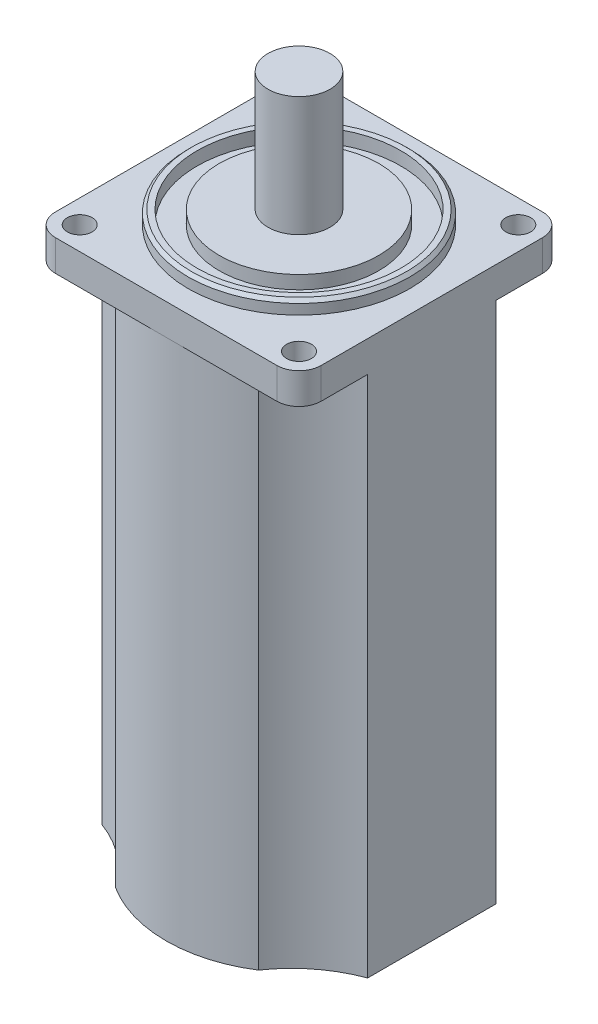
ISO-10303-21;
HEADER;
FILE_DESCRIPTION(('STEP AP214'),'2;1');
FILE_NAME('part.step','',(''),(''),'','','');
FILE_SCHEMA(('AUTOMOTIVE_DESIGN { 1 0 10303 214 1 1 1 1 }'));
ENDSEC;
DATA;
#1=APPLICATION_CONTEXT('core data for automotive mechanical design processes');
#2=APPLICATION_PROTOCOL_DEFINITION('international standard','automotive_design',2000,#1);
#3=PRODUCT_CONTEXT('',#1,'mechanical');
#4=PRODUCT('Part','Part','',(#3));
#5=PRODUCT_RELATED_PRODUCT_CATEGORY('part','',(#4));
#6=PRODUCT_DEFINITION_FORMATION('','',#4);
#7=PRODUCT_DEFINITION_CONTEXT('part definition',#1,'design');
#8=PRODUCT_DEFINITION('design','',#6,#7);
#9=PRODUCT_DEFINITION_SHAPE('','',#8);
#10=(LENGTH_UNIT() NAMED_UNIT(*) SI_UNIT(.MILLI.,.METRE.));
#11=(NAMED_UNIT(*) PLANE_ANGLE_UNIT() SI_UNIT($,.RADIAN.));
#12=(NAMED_UNIT(*) SI_UNIT($,.STERADIAN.) SOLID_ANGLE_UNIT());
#13=UNCERTAINTY_MEASURE_WITH_UNIT(LENGTH_MEASURE(1.E-05),#10,'distance_accuracy_value','');
#14=(GEOMETRIC_REPRESENTATION_CONTEXT(3) GLOBAL_UNCERTAINTY_ASSIGNED_CONTEXT((#13)) GLOBAL_UNIT_ASSIGNED_CONTEXT((#10,
#11,#12)) REPRESENTATION_CONTEXT('',''));
#15=CARTESIAN_POINT('',(0.,0.,0.));
#16=DIRECTION('',(0.,0.,1.));
#17=DIRECTION('',(1.,0.,0.));
#18=AXIS2_PLACEMENT_3D('',#15,#16,#17);
#19=CARTESIAN_POINT('',(-25.,0.,25.));
#20=DIRECTION('',(0.,-1.,0.));
#21=DIRECTION('',(0.,0.,-1.));
#22=AXIS2_PLACEMENT_3D('',#19,#20,#21);
#23=PLANE('',#22);
#24=CARTESIAN_POINT('',(40.0314224653781,0.,-41.7097512543042));
#25=DIRECTION('',(0.,1.,0.));
#26=DIRECTION('',(0.,0.,1.));
#27=AXIS2_PLACEMENT_3D('',#24,#25,#26);
#28=CIRCLE('',#27,29.);
#29=CARTESIAN_POINT('',(16.12,0.,-25.3010987903688));
#30=VERTEX_POINT('',#29);
#31=CARTESIAN_POINT('',(30.,0.,-14.5));
#32=VERTEX_POINT('',#31);
#33=EDGE_CURVE('E57',#30,#32,#28,.T.);
#34=ORIENTED_EDGE('',*,*,#33,.F.);
#35=CARTESIAN_POINT('',(0.,0.,0.));
#36=DIRECTION('',(0.,-1.,0.));
#37=DIRECTION('',(0.,0.,1.));
#38=AXIS2_PLACEMENT_3D('',#35,#36,#37);
#39=CIRCLE('',#38,30.);
#40=CARTESIAN_POINT('',(0.,0.,-30.));
#41=VERTEX_POINT('',#40);
#42=EDGE_CURVE('E49',#41,#30,#39,.T.);
#43=ORIENTED_EDGE('',*,*,#42,.F.);
#44=DIRECTION('',(-1.,0.,0.));
#45=VECTOR('',#44,1.);
#46=CARTESIAN_POINT('',(-25.,0.,-30.));
#47=LINE('',#46,#45);
#48=CARTESIAN_POINT('',(25.,0.,-30.));
#49=VERTEX_POINT('',#48);
#50=EDGE_CURVE('E260',#49,#41,#47,.T.);
#51=ORIENTED_EDGE('',*,*,#50,.F.);
#52=CARTESIAN_POINT('',(25.,0.,-25.));
#53=DIRECTION('',(0.,1.,0.));
#54=DIRECTION('',(0.,0.,-1.));
#55=AXIS2_PLACEMENT_3D('',#52,#53,#54);
#56=CIRCLE('',#55,5.);
#57=CARTESIAN_POINT('',(30.,0.,-25.));
#58=VERTEX_POINT('',#57);
#59=EDGE_CURVE('E257',#58,#49,#56,.T.);
#60=ORIENTED_EDGE('',*,*,#59,.F.);
#61=DIRECTION('',(0.,0.,-1.));
#62=VECTOR('',#61,1.);
#63=CARTESIAN_POINT('',(30.,0.,25.));
#64=LINE('',#63,#62);
#65=EDGE_CURVE('E253',#32,#58,#64,.T.);
#66=ORIENTED_EDGE('',*,*,#65,.F.);
#67=EDGE_LOOP('',(#34,#43,#51,#60,#66));
#68=FACE_BOUND('',#67,.T.);
#69=CARTESIAN_POINT('',(24.7487373415292,0.,-24.7487373415292));
#70=DIRECTION('',(0.,1.,0.));
#71=DIRECTION('',(0.,0.,-1.));
#72=AXIS2_PLACEMENT_3D('',#69,#70,#71);
#73=CIRCLE('',#72,2.8);
#74=CARTESIAN_POINT('',(24.7487373415292,0.,-27.5487373415292));
#75=VERTEX_POINT('',#74);
#76=EDGE_CURVE('E211',#75,#75,#73,.T.);
#77=ORIENTED_EDGE('',*,*,#76,.T.);
#78=EDGE_LOOP('',(#77));
#79=FACE_BOUND('',#78,.T.);
#80=ADVANCED_FACE('F40',(#68,#79),#23,.T.);
#81=CARTESIAN_POINT('',(-16.12,0.,-25.3010987903688));
#82=VERTEX_POINT('',#81);
#83=EDGE_CURVE('E65',#82,#41,#39,.T.);
#84=ORIENTED_EDGE('',*,*,#83,.F.);
#85=CARTESIAN_POINT('',(-40.031422465378,0.,-41.7097512543042));
#86=DIRECTION('',(0.,1.,0.));
#87=DIRECTION('',(0.,0.,-1.));
#88=AXIS2_PLACEMENT_3D('',#85,#86,#87);
#89=CIRCLE('',#88,29.);
#90=CARTESIAN_POINT('',(-30.,0.,-14.5));
#91=VERTEX_POINT('',#90);
#92=EDGE_CURVE('E311',#91,#82,#89,.T.);
#93=ORIENTED_EDGE('',*,*,#92,.F.);
#94=DIRECTION('',(0.,0.,1.));
#95=VECTOR('',#94,1.);
#96=CARTESIAN_POINT('',(-30.,0.,25.));
#97=LINE('',#96,#95);
#98=CARTESIAN_POINT('',(-30.,0.,-25.));
#99=VERTEX_POINT('',#98);
#100=EDGE_CURVE('E230',#99,#91,#97,.T.);
#101=ORIENTED_EDGE('',*,*,#100,.F.);
#102=CARTESIAN_POINT('',(-25.,0.,-25.));
#103=DIRECTION('',(0.,1.,0.));
#104=DIRECTION('',(0.,0.,-1.));
#105=AXIS2_PLACEMENT_3D('',#102,#103,#104);
#106=CIRCLE('',#105,5.);
#107=CARTESIAN_POINT('',(-25.,0.,-30.));
#108=VERTEX_POINT('',#107);
#109=EDGE_CURVE('E263',#108,#99,#106,.T.);
#110=ORIENTED_EDGE('',*,*,#109,.F.);
#111=EDGE_CURVE('E259',#41,#108,#47,.T.);
#112=ORIENTED_EDGE('',*,*,#111,.F.);
#113=EDGE_LOOP('',(#84,#93,#101,#110,#112));
#114=FACE_BOUND('',#113,.T.);
#115=CARTESIAN_POINT('',(-24.7487373415292,0.,-24.7487373415292));
#116=DIRECTION('',(0.,1.,0.));
#117=DIRECTION('',(0.,0.,1.));
#118=AXIS2_PLACEMENT_3D('',#115,#116,#117);
#119=CIRCLE('',#118,2.8);
#120=CARTESIAN_POINT('',(-24.7487373415292,0.,-21.9487373415292));
#121=VERTEX_POINT('',#120);
#122=EDGE_CURVE('E217',#121,#121,#119,.T.);
#123=ORIENTED_EDGE('',*,*,#122,.T.);
#124=EDGE_LOOP('',(#123));
#125=FACE_BOUND('',#124,.T.);
#126=ADVANCED_FACE('F365',(#114,#125),#23,.T.);
#127=CARTESIAN_POINT('',(40.0314224653781,0.,41.7097512543042));
#128=DIRECTION('',(0.,1.,0.));
#129=DIRECTION('',(0.,0.,-1.));
#130=AXIS2_PLACEMENT_3D('',#127,#128,#129);
#131=CIRCLE('',#130,29.);
#132=CARTESIAN_POINT('',(30.,0.,14.5));
#133=VERTEX_POINT('',#132);
#134=CARTESIAN_POINT('',(16.12,0.,25.3010987903688));
#135=VERTEX_POINT('',#134);
#136=EDGE_CURVE('E186',#133,#135,#131,.T.);
#137=ORIENTED_EDGE('',*,*,#136,.F.);
#138=CARTESIAN_POINT('',(30.,0.,25.));
#139=VERTEX_POINT('',#138);
#140=EDGE_CURVE('E254',#139,#133,#64,.T.);
#141=ORIENTED_EDGE('',*,*,#140,.F.);
#142=CARTESIAN_POINT('',(25.,0.,25.));
#143=DIRECTION('',(0.,1.,0.));
#144=DIRECTION('',(0.,0.,1.));
#145=AXIS2_PLACEMENT_3D('',#142,#143,#144);
#146=CIRCLE('',#145,5.);
#147=CARTESIAN_POINT('',(25.,0.,30.));
#148=VERTEX_POINT('',#147);
#149=EDGE_CURVE('E251',#148,#139,#146,.T.);
#150=ORIENTED_EDGE('',*,*,#149,.F.);
#151=DIRECTION('',(1.,0.,0.));
#152=VECTOR('',#151,1.);
#153=CARTESIAN_POINT('',(-25.,0.,30.));
#154=LINE('',#153,#152);
#155=CARTESIAN_POINT('',(0.,0.,30.));
#156=VERTEX_POINT('',#155);
#157=EDGE_CURVE('E247',#156,#148,#154,.T.);
#158=ORIENTED_EDGE('',*,*,#157,.F.);
#159=CARTESIAN_POINT('',(0.,0.,0.));
#160=DIRECTION('',(0.,-1.,0.));
#161=DIRECTION('',(0.,0.,-1.));
#162=AXIS2_PLACEMENT_3D('',#159,#160,#161);
#163=CIRCLE('',#162,30.);
#164=EDGE_CURVE('E305',#135,#156,#163,.T.);
#165=ORIENTED_EDGE('',*,*,#164,.F.);
#166=EDGE_LOOP('',(#137,#141,#150,#158,#165));
#167=FACE_BOUND('',#166,.T.);
#168=CARTESIAN_POINT('',(24.7487373415292,0.,24.7487373415292));
#169=DIRECTION('',(0.,1.,0.));
#170=DIRECTION('',(0.,0.,1.));
#171=AXIS2_PLACEMENT_3D('',#168,#169,#170);
#172=CIRCLE('',#171,2.8);
#173=CARTESIAN_POINT('',(24.7487373415292,0.,27.5487373415292));
#174=VERTEX_POINT('',#173);
#175=EDGE_CURVE('E205',#174,#174,#172,.T.);
#176=ORIENTED_EDGE('',*,*,#175,.T.);
#177=EDGE_LOOP('',(#176));
#178=FACE_BOUND('',#177,.T.);
#179=ADVANCED_FACE('F400',(#167,#178),#23,.T.);
#180=CARTESIAN_POINT('',(-25.,7.,25.));
#181=DIRECTION('',(0.,-1.,0.));
#182=DIRECTION('',(0.,0.,-1.));
#183=AXIS2_PLACEMENT_3D('',#180,#181,#182);
#184=PLANE('',#183);
#185=CARTESIAN_POINT('',(0.,7.,0.));
#186=DIRECTION('',(0.,-1.,0.));
#187=DIRECTION('',(0.,0.,-1.));
#188=AXIS2_PLACEMENT_3D('',#185,#186,#187);
#189=CIRCLE('',#188,25.);
#190=CARTESIAN_POINT('',(0.,7.,-25.));
#191=VERTEX_POINT('',#190);
#192=EDGE_CURVE('E291',#191,#191,#189,.F.);
#193=ORIENTED_EDGE('',*,*,#192,.F.);
#194=EDGE_LOOP('',(#193));
#195=FACE_BOUND('',#194,.T.);
#196=CARTESIAN_POINT('',(-25.,7.,25.));
#197=DIRECTION('',(0.,1.,0.));
#198=DIRECTION('',(0.,0.,-1.));
#199=AXIS2_PLACEMENT_3D('',#196,#197,#198);
#200=CIRCLE('',#199,5.);
#201=CARTESIAN_POINT('',(-30.,7.,25.));
#202=VERTEX_POINT('',#201);
#203=CARTESIAN_POINT('',(-25.,7.,30.));
#204=VERTEX_POINT('',#203);
#205=EDGE_CURVE('E226',#202,#204,#200,.T.);
#206=ORIENTED_EDGE('',*,*,#205,.T.);
#207=DIRECTION('',(1.,0.,0.));
#208=VECTOR('',#207,1.);
#209=CARTESIAN_POINT('',(-25.,7.,30.));
#210=LINE('',#209,#208);
#211=CARTESIAN_POINT('',(25.,7.,30.));
#212=VERTEX_POINT('',#211);
#213=EDGE_CURVE('E229',#204,#212,#210,.T.);
#214=ORIENTED_EDGE('',*,*,#213,.T.);
#215=CARTESIAN_POINT('',(25.,7.,25.));
#216=DIRECTION('',(0.,1.,0.));
#217=DIRECTION('',(0.,0.,1.));
#218=AXIS2_PLACEMENT_3D('',#215,#216,#217);
#219=CIRCLE('',#218,5.);
#220=CARTESIAN_POINT('',(30.,7.,25.));
#221=VERTEX_POINT('',#220);
#222=EDGE_CURVE('E232',#212,#221,#219,.T.);
#223=ORIENTED_EDGE('',*,*,#222,.T.);
#224=DIRECTION('',(0.,0.,-1.));
#225=VECTOR('',#224,1.);
#226=CARTESIAN_POINT('',(30.,7.,25.));
#227=LINE('',#226,#225);
#228=CARTESIAN_POINT('',(30.,7.,-25.));
#229=VERTEX_POINT('',#228);
#230=EDGE_CURVE('E234',#221,#229,#227,.T.);
#231=ORIENTED_EDGE('',*,*,#230,.T.);
#232=CARTESIAN_POINT('',(25.,7.,-25.));
#233=DIRECTION('',(0.,1.,0.));
#234=DIRECTION('',(0.,0.,-1.));
#235=AXIS2_PLACEMENT_3D('',#232,#233,#234);
#236=CIRCLE('',#235,5.);
#237=CARTESIAN_POINT('',(25.,7.,-30.));
#238=VERTEX_POINT('',#237);
#239=EDGE_CURVE('E236',#229,#238,#236,.T.);
#240=ORIENTED_EDGE('',*,*,#239,.T.);
#241=DIRECTION('',(-1.,0.,0.));
#242=VECTOR('',#241,1.);
#243=CARTESIAN_POINT('',(-25.,7.,-30.));
#244=LINE('',#243,#242);
#245=CARTESIAN_POINT('',(-25.,7.,-30.));
#246=VERTEX_POINT('',#245);
#247=EDGE_CURVE('E238',#238,#246,#244,.T.);
#248=ORIENTED_EDGE('',*,*,#247,.T.);
#249=CARTESIAN_POINT('',(-25.,7.,-25.));
#250=DIRECTION('',(0.,1.,0.));
#251=DIRECTION('',(0.,0.,-1.));
#252=AXIS2_PLACEMENT_3D('',#249,#250,#251);
#253=CIRCLE('',#252,5.);
#254=CARTESIAN_POINT('',(-30.,7.,-25.));
#255=VERTEX_POINT('',#254);
#256=EDGE_CURVE('E240',#246,#255,#253,.T.);
#257=ORIENTED_EDGE('',*,*,#256,.T.);
#258=DIRECTION('',(0.,0.,1.));
#259=VECTOR('',#258,1.);
#260=CARTESIAN_POINT('',(-30.,7.,25.));
#261=LINE('',#260,#259);
#262=EDGE_CURVE('E242',#255,#202,#261,.T.);
#263=ORIENTED_EDGE('',*,*,#262,.T.);
#264=EDGE_LOOP('',(#206,#214,#223,#231,#240,#248,#257,#263));
#265=FACE_BOUND('',#264,.T.);
#266=CARTESIAN_POINT('',(-24.7487373415292,7.,-24.7487373415292));
#267=DIRECTION('',(0.,1.,0.));
#268=DIRECTION('',(0.,0.,1.));
#269=AXIS2_PLACEMENT_3D('',#266,#267,#268);
#270=CIRCLE('',#269,2.8);
#271=CARTESIAN_POINT('',(-24.7487373415292,7.,-21.9487373415292));
#272=VERTEX_POINT('',#271);
#273=EDGE_CURVE('E220',#272,#272,#270,.T.);
#274=ORIENTED_EDGE('',*,*,#273,.F.);
#275=EDGE_LOOP('',(#274));
#276=FACE_BOUND('',#275,.T.);
#277=CARTESIAN_POINT('',(24.7487373415292,7.,-24.7487373415292));
#278=DIRECTION('',(0.,1.,0.));
#279=DIRECTION('',(0.,0.,-1.));
#280=AXIS2_PLACEMENT_3D('',#277,#278,#279);
#281=CIRCLE('',#280,2.8);
#282=CARTESIAN_POINT('',(24.7487373415292,7.,-27.5487373415292));
#283=VERTEX_POINT('',#282);
#284=EDGE_CURVE('E214',#283,#283,#281,.T.);
#285=ORIENTED_EDGE('',*,*,#284,.F.);
#286=EDGE_LOOP('',(#285));
#287=FACE_BOUND('',#286,.T.);
#288=CARTESIAN_POINT('',(24.7487373415292,7.,24.7487373415292));
#289=DIRECTION('',(0.,1.,0.));
#290=DIRECTION('',(0.,0.,1.));
#291=AXIS2_PLACEMENT_3D('',#288,#289,#290);
#292=CIRCLE('',#291,2.8);
#293=CARTESIAN_POINT('',(24.7487373415292,7.,27.5487373415292));
#294=VERTEX_POINT('',#293);
#295=EDGE_CURVE('E208',#294,#294,#292,.T.);
#296=ORIENTED_EDGE('',*,*,#295,.F.);
#297=EDGE_LOOP('',(#296));
#298=FACE_BOUND('',#297,.T.);
#299=CARTESIAN_POINT('',(-24.7487373415292,7.,24.7487373415292));
#300=DIRECTION('',(0.,1.,0.));
#301=DIRECTION('',(0.,0.,-1.));
#302=AXIS2_PLACEMENT_3D('',#299,#300,#301);
#303=CIRCLE('',#302,2.8);
#304=CARTESIAN_POINT('',(-24.7487373415292,7.,21.9487373415292));
#305=VERTEX_POINT('',#304);
#306=EDGE_CURVE('E202',#305,#305,#303,.T.);
#307=ORIENTED_EDGE('',*,*,#306,.F.);
#308=EDGE_LOOP('',(#307));
#309=FACE_BOUND('',#308,.T.);
#310=ADVANCED_FACE('F377',(#195,#265,#276,#287,#298,#309),#184,.F.);
#311=CARTESIAN_POINT('',(-40.031422465378,0.,41.7097512543042));
#312=DIRECTION('',(0.,1.,0.));
#313=DIRECTION('',(0.,0.,1.));
#314=AXIS2_PLACEMENT_3D('',#311,#312,#313);
#315=CIRCLE('',#314,29.);
#316=CARTESIAN_POINT('',(-16.12,0.,25.3010987903688));
#317=VERTEX_POINT('',#316);
#318=CARTESIAN_POINT('',(-30.,0.,14.5));
#319=VERTEX_POINT('',#318);
#320=EDGE_CURVE('E309',#317,#319,#315,.T.);
#321=ORIENTED_EDGE('',*,*,#320,.F.);
#322=EDGE_CURVE('E301',#156,#317,#163,.T.);
#323=ORIENTED_EDGE('',*,*,#322,.F.);
#324=CARTESIAN_POINT('',(-25.,0.,30.));
#325=VERTEX_POINT('',#324);
#326=EDGE_CURVE('E248',#325,#156,#154,.T.);
#327=ORIENTED_EDGE('',*,*,#326,.F.);
#328=CARTESIAN_POINT('',(-25.,0.,25.));
#329=DIRECTION('',(0.,1.,0.));
#330=DIRECTION('',(0.,0.,-1.));
#331=AXIS2_PLACEMENT_3D('',#328,#329,#330);
#332=CIRCLE('',#331,5.);
#333=CARTESIAN_POINT('',(-30.,0.,25.));
#334=VERTEX_POINT('',#333);
#335=EDGE_CURVE('E223',#334,#325,#332,.T.);
#336=ORIENTED_EDGE('',*,*,#335,.F.);
#337=EDGE_CURVE('E265',#319,#334,#97,.T.);
#338=ORIENTED_EDGE('',*,*,#337,.F.);
#339=EDGE_LOOP('',(#321,#323,#327,#336,#338));
#340=FACE_BOUND('',#339,.T.);
#341=CARTESIAN_POINT('',(-24.7487373415292,0.,24.7487373415292));
#342=DIRECTION('',(0.,1.,0.));
#343=DIRECTION('',(0.,0.,-1.));
#344=AXIS2_PLACEMENT_3D('',#341,#342,#343);
#345=CIRCLE('',#344,2.8);
#346=CARTESIAN_POINT('',(-24.7487373415292,0.,21.9487373415292));
#347=VERTEX_POINT('',#346);
#348=EDGE_CURVE('E199',#347,#347,#345,.T.);
#349=ORIENTED_EDGE('',*,*,#348,.T.);
#350=EDGE_LOOP('',(#349));
#351=FACE_BOUND('',#350,.T.);
#352=ADVANCED_FACE('F406',(#340,#351),#23,.T.);
#353=CARTESIAN_POINT('',(-25.,7.,25.));
#354=DIRECTION('',(0.,-1.,0.));
#355=DIRECTION('',(0.,0.,-1.));
#356=AXIS2_PLACEMENT_3D('',#353,#354,#355);
#357=CYLINDRICAL_SURFACE('',#356,5.);
#358=ORIENTED_EDGE('',*,*,#335,.T.);
#359=DIRECTION('',(0.,-1.,0.));
#360=VECTOR('',#359,1.);
#361=CARTESIAN_POINT('',(-25.,7.,30.));
#362=LINE('',#361,#360);
#363=EDGE_CURVE('E288',#204,#325,#362,.T.);
#364=ORIENTED_EDGE('',*,*,#363,.F.);
#365=ORIENTED_EDGE('',*,*,#205,.F.);
#366=DIRECTION('',(0.,-1.,0.));
#367=VECTOR('',#366,1.);
#368=CARTESIAN_POINT('',(-30.,7.,25.));
#369=LINE('',#368,#367);
#370=EDGE_CURVE('E244',#202,#334,#369,.T.);
#371=ORIENTED_EDGE('',*,*,#370,.T.);
#372=EDGE_LOOP('',(#358,#364,#365,#371));
#373=FACE_BOUND('',#372,.T.);
#374=ADVANCED_FACE('F409',(#373),#357,.T.);
#375=CARTESIAN_POINT('',(-25.,7.,30.));
#376=DIRECTION('',(0.,0.,-1.));
#377=DIRECTION('',(-1.,0.,0.));
#378=AXIS2_PLACEMENT_3D('',#375,#376,#377);
#379=PLANE('',#378);
#380=ORIENTED_EDGE('',*,*,#326,.T.);
#381=ORIENTED_EDGE('',*,*,#157,.T.);
#382=DIRECTION('',(0.,-1.,0.));
#383=VECTOR('',#382,1.);
#384=CARTESIAN_POINT('',(25.,7.,30.));
#385=LINE('',#384,#383);
#386=EDGE_CURVE('E285',#212,#148,#385,.T.);
#387=ORIENTED_EDGE('',*,*,#386,.F.);
#388=ORIENTED_EDGE('',*,*,#213,.F.);
#389=ORIENTED_EDGE('',*,*,#363,.T.);
#390=EDGE_LOOP('',(#380,#381,#387,#388,#389));
#391=FACE_BOUND('',#390,.T.);
#392=ADVANCED_FACE('F403',(#391),#379,.F.);
#393=CARTESIAN_POINT('',(25.,7.,25.));
#394=DIRECTION('',(0.,-1.,0.));
#395=DIRECTION('',(0.,0.,-1.));
#396=AXIS2_PLACEMENT_3D('',#393,#394,#395);
#397=CYLINDRICAL_SURFACE('',#396,5.);
#398=ORIENTED_EDGE('',*,*,#149,.T.);
#399=DIRECTION('',(0.,-1.,0.));
#400=VECTOR('',#399,1.);
#401=CARTESIAN_POINT('',(30.,7.,25.));
#402=LINE('',#401,#400);
#403=EDGE_CURVE('E282',#221,#139,#402,.T.);
#404=ORIENTED_EDGE('',*,*,#403,.F.);
#405=ORIENTED_EDGE('',*,*,#222,.F.);
#406=ORIENTED_EDGE('',*,*,#386,.T.);
#407=EDGE_LOOP('',(#398,#404,#405,#406));
#408=FACE_BOUND('',#407,.T.);
#409=ADVANCED_FACE('F396',(#408),#397,.T.);
#410=CARTESIAN_POINT('',(30.,7.,25.));
#411=DIRECTION('',(-1.,0.,0.));
#412=DIRECTION('',(0.,0.,1.));
#413=AXIS2_PLACEMENT_3D('',#410,#411,#412);
#414=PLANE('',#413);
#415=ORIENTED_EDGE('',*,*,#140,.T.);
#416=DIRECTION('',(0.,1.,0.));
#417=VECTOR('',#416,1.);
#418=CARTESIAN_POINT('',(30.,-118.,14.5));
#419=LINE('',#418,#417);
#420=CARTESIAN_POINT('',(30.,-118.,14.5));
#421=VERTEX_POINT('',#420);
#422=EDGE_CURVE('E317',#421,#133,#419,.T.);
#423=ORIENTED_EDGE('',*,*,#422,.F.);
#424=DIRECTION('',(0.,0.,1.));
#425=VECTOR('',#424,1.);
#426=CARTESIAN_POINT('',(30.,-118.,14.5));
#427=LINE('',#426,#425);
#428=CARTESIAN_POINT('',(30.,-118.,-14.5));
#429=VERTEX_POINT('',#428);
#430=EDGE_CURVE('E180',#429,#421,#427,.T.);
#431=ORIENTED_EDGE('',*,*,#430,.F.);
#432=DIRECTION('',(0.,1.,0.));
#433=VECTOR('',#432,1.);
#434=CARTESIAN_POINT('',(30.,-118.,-14.5));
#435=LINE('',#434,#433);
#436=EDGE_CURVE('E353',#429,#32,#435,.T.);
#437=ORIENTED_EDGE('',*,*,#436,.T.);
#438=ORIENTED_EDGE('',*,*,#65,.T.);
#439=DIRECTION('',(0.,-1.,0.));
#440=VECTOR('',#439,1.);
#441=CARTESIAN_POINT('',(30.,7.,-25.));
#442=LINE('',#441,#440);
#443=EDGE_CURVE('E279',#229,#58,#442,.T.);
#444=ORIENTED_EDGE('',*,*,#443,.F.);
#445=ORIENTED_EDGE('',*,*,#230,.F.);
#446=ORIENTED_EDGE('',*,*,#403,.T.);
#447=EDGE_LOOP('',(#415,#423,#431,#437,#438,#444,#445,#446));
#448=FACE_BOUND('',#447,.T.);
#449=ADVANCED_FACE('F359',(#448),#414,.F.);
#450=CARTESIAN_POINT('',(25.,7.,-25.));
#451=DIRECTION('',(0.,-1.,0.));
#452=DIRECTION('',(0.,0.,-1.));
#453=AXIS2_PLACEMENT_3D('',#450,#451,#452);
#454=CYLINDRICAL_SURFACE('',#453,5.);
#455=ORIENTED_EDGE('',*,*,#59,.T.);
#456=DIRECTION('',(0.,-1.,0.));
#457=VECTOR('',#456,1.);
#458=CARTESIAN_POINT('',(25.,7.,-30.));
#459=LINE('',#458,#457);
#460=EDGE_CURVE('E276',#238,#49,#459,.T.);
#461=ORIENTED_EDGE('',*,*,#460,.F.);
#462=ORIENTED_EDGE('',*,*,#239,.F.);
#463=ORIENTED_EDGE('',*,*,#443,.T.);
#464=EDGE_LOOP('',(#455,#461,#462,#463));
#465=FACE_BOUND('',#464,.T.);
#466=ADVANCED_FACE('F389',(#465),#454,.T.);
#467=CARTESIAN_POINT('',(-25.,7.,-30.));
#468=DIRECTION('',(0.,0.,1.));
#469=DIRECTION('',(1.,0.,0.));
#470=AXIS2_PLACEMENT_3D('',#467,#468,#469);
#471=PLANE('',#470);
#472=ORIENTED_EDGE('',*,*,#50,.T.);
#473=ORIENTED_EDGE('',*,*,#111,.T.);
#474=DIRECTION('',(0.,-1.,0.));
#475=VECTOR('',#474,1.);
#476=CARTESIAN_POINT('',(-25.,7.,-30.));
#477=LINE('',#476,#475);
#478=EDGE_CURVE('E273',#246,#108,#477,.T.);
#479=ORIENTED_EDGE('',*,*,#478,.F.);
#480=ORIENTED_EDGE('',*,*,#247,.F.);
#481=ORIENTED_EDGE('',*,*,#460,.T.);
#482=EDGE_LOOP('',(#472,#473,#479,#480,#481));
#483=FACE_BOUND('',#482,.T.);
#484=ADVANCED_FACE('F384',(#483),#471,.F.);
#485=CARTESIAN_POINT('',(-25.,7.,-25.));
#486=DIRECTION('',(0.,-1.,0.));
#487=DIRECTION('',(0.,0.,-1.));
#488=AXIS2_PLACEMENT_3D('',#485,#486,#487);
#489=CYLINDRICAL_SURFACE('',#488,5.);
#490=ORIENTED_EDGE('',*,*,#109,.T.);
#491=DIRECTION('',(0.,-1.,0.));
#492=VECTOR('',#491,1.);
#493=CARTESIAN_POINT('',(-30.,7.,-25.));
#494=LINE('',#493,#492);
#495=EDGE_CURVE('E270',#255,#99,#494,.T.);
#496=ORIENTED_EDGE('',*,*,#495,.F.);
#497=ORIENTED_EDGE('',*,*,#256,.F.);
#498=ORIENTED_EDGE('',*,*,#478,.T.);
#499=EDGE_LOOP('',(#490,#496,#497,#498));
#500=FACE_BOUND('',#499,.T.);
#501=ADVANCED_FACE('F370',(#500),#489,.T.);
#502=CARTESIAN_POINT('',(-30.,7.,25.));
#503=DIRECTION('',(1.,0.,0.));
#504=DIRECTION('',(0.,0.,-1.));
#505=AXIS2_PLACEMENT_3D('',#502,#503,#504);
#506=PLANE('',#505);
#507=ORIENTED_EDGE('',*,*,#100,.T.);
#508=DIRECTION('',(0.,1.,0.));
#509=VECTOR('',#508,1.);
#510=CARTESIAN_POINT('',(-30.,-118.,-14.5));
#511=LINE('',#510,#509);
#512=CARTESIAN_POINT('',(-30.,-118.,-14.5));
#513=VERTEX_POINT('',#512);
#514=EDGE_CURVE('E333',#513,#91,#511,.T.);
#515=ORIENTED_EDGE('',*,*,#514,.F.);
#516=DIRECTION('',(0.,0.,-1.));
#517=VECTOR('',#516,1.);
#518=CARTESIAN_POINT('',(-30.,-118.,14.5));
#519=LINE('',#518,#517);
#520=CARTESIAN_POINT('',(-30.,-118.,14.5));
#521=VERTEX_POINT('',#520);
#522=EDGE_CURVE('E324',#521,#513,#519,.T.);
#523=ORIENTED_EDGE('',*,*,#522,.F.);
#524=DIRECTION('',(0.,1.,0.));
#525=VECTOR('',#524,1.);
#526=CARTESIAN_POINT('',(-30.,-118.,14.5));
#527=LINE('',#526,#525);
#528=EDGE_CURVE('E192',#521,#319,#527,.T.);
#529=ORIENTED_EDGE('',*,*,#528,.T.);
#530=ORIENTED_EDGE('',*,*,#337,.T.);
#531=ORIENTED_EDGE('',*,*,#370,.F.);
#532=ORIENTED_EDGE('',*,*,#262,.F.);
#533=ORIENTED_EDGE('',*,*,#495,.T.);
#534=EDGE_LOOP('',(#507,#515,#523,#529,#530,#531,#532,#533));
#535=FACE_BOUND('',#534,.T.);
#536=ADVANCED_FACE('F334',(#535),#506,.F.);
#537=CARTESIAN_POINT('',(-24.7487373415292,7.,-24.7487373415292));
#538=DIRECTION('',(0.,-1.,0.));
#539=DIRECTION('',(0.,0.,-1.));
#540=AXIS2_PLACEMENT_3D('',#537,#538,#539);
#541=CYLINDRICAL_SURFACE('',#540,2.8);
#542=ORIENTED_EDGE('',*,*,#273,.T.);
#543=EDGE_LOOP('',(#542));
#544=FACE_BOUND('',#543,.T.);
#545=ORIENTED_EDGE('',*,*,#122,.F.);
#546=EDGE_LOOP('',(#545));
#547=FACE_BOUND('',#546,.T.);
#548=ADVANCED_FACE('F426',(#544,#547),#541,.F.);
#549=CARTESIAN_POINT('',(24.7487373415292,7.,-24.7487373415292));
#550=DIRECTION('',(0.,-1.,0.));
#551=DIRECTION('',(0.,0.,-1.));
#552=AXIS2_PLACEMENT_3D('',#549,#550,#551);
#553=CYLINDRICAL_SURFACE('',#552,2.8);
#554=ORIENTED_EDGE('',*,*,#284,.T.);
#555=EDGE_LOOP('',(#554));
#556=FACE_BOUND('',#555,.T.);
#557=ORIENTED_EDGE('',*,*,#76,.F.);
#558=EDGE_LOOP('',(#557));
#559=FACE_BOUND('',#558,.T.);
#560=ADVANCED_FACE('F467',(#556,#559),#553,.F.);
#561=CARTESIAN_POINT('',(24.7487373415292,7.,24.7487373415292));
#562=DIRECTION('',(0.,-1.,0.));
#563=DIRECTION('',(0.,0.,-1.));
#564=AXIS2_PLACEMENT_3D('',#561,#562,#563);
#565=CYLINDRICAL_SURFACE('',#564,2.8);
#566=ORIENTED_EDGE('',*,*,#295,.T.);
#567=EDGE_LOOP('',(#566));
#568=FACE_BOUND('',#567,.T.);
#569=ORIENTED_EDGE('',*,*,#175,.F.);
#570=EDGE_LOOP('',(#569));
#571=FACE_BOUND('',#570,.T.);
#572=ADVANCED_FACE('F474',(#568,#571),#565,.F.);
#573=CARTESIAN_POINT('',(-24.7487373415292,7.,24.7487373415292));
#574=DIRECTION('',(0.,-1.,0.));
#575=DIRECTION('',(0.,0.,-1.));
#576=AXIS2_PLACEMENT_3D('',#573,#574,#575);
#577=CYLINDRICAL_SURFACE('',#576,2.8);
#578=ORIENTED_EDGE('',*,*,#306,.T.);
#579=EDGE_LOOP('',(#578));
#580=FACE_BOUND('',#579,.T.);
#581=ORIENTED_EDGE('',*,*,#348,.F.);
#582=EDGE_LOOP('',(#581));
#583=FACE_BOUND('',#582,.T.);
#584=ADVANCED_FACE('F482',(#580,#583),#577,.F.);
#585=CARTESIAN_POINT('',(0.,10.,0.));
#586=DIRECTION('',(0.,-1.,0.));
#587=DIRECTION('',(0.,0.,-1.));
#588=AXIS2_PLACEMENT_3D('',#585,#586,#587);
#589=CYLINDRICAL_SURFACE('',#588,23.);
#590=CARTESIAN_POINT('',(0.,10.,0.));
#591=DIRECTION('',(0.,1.,0.));
#592=DIRECTION('',(0.,0.,1.));
#593=AXIS2_PLACEMENT_3D('',#590,#591,#592);
#594=CIRCLE('',#593,23.);
#595=CARTESIAN_POINT('',(0.,10.,23.));
#596=VERTEX_POINT('',#595);
#597=EDGE_CURVE('E196',#596,#596,#594,.T.);
#598=ORIENTED_EDGE('',*,*,#597,.T.);
#599=EDGE_LOOP('',(#598));
#600=FACE_BOUND('',#599,.T.);
#601=CARTESIAN_POINT('',(0.,7.,0.));
#602=DIRECTION('',(0.,1.,0.));
#603=DIRECTION('',(0.,0.,1.));
#604=AXIS2_PLACEMENT_3D('',#601,#602,#603);
#605=CIRCLE('',#604,23.);
#606=CARTESIAN_POINT('',(0.,7.,23.));
#607=VERTEX_POINT('',#606);
#608=EDGE_CURVE('E190',#607,#607,#605,.T.);
#609=ORIENTED_EDGE('',*,*,#608,.F.);
#610=EDGE_LOOP('',(#609));
#611=FACE_BOUND('',#610,.T.);
#612=ADVANCED_FACE('F490',(#600,#611),#589,.F.);
#613=CARTESIAN_POINT('',(0.,10.,0.));
#614=DIRECTION('',(0.,-1.,0.));
#615=DIRECTION('',(0.,0.,-1.));
#616=AXIS2_PLACEMENT_3D('',#613,#614,#615);
#617=CYLINDRICAL_SURFACE('',#616,25.);
#618=CARTESIAN_POINT('',(0.,9.28999999999999,0.));
#619=DIRECTION('',(0.,1.,0.));
#620=DIRECTION('',(0.,0.,1.));
#621=AXIS2_PLACEMENT_3D('',#618,#619,#620);
#622=CIRCLE('',#621,25.);
#623=CARTESIAN_POINT('',(0.,9.28999999999999,25.));
#624=VERTEX_POINT('',#623);
#625=EDGE_CURVE('E44',#624,#624,#622,.F.);
#626=ORIENTED_EDGE('',*,*,#625,.T.);
#627=EDGE_LOOP('',(#626));
#628=FACE_BOUND('',#627,.T.);
#629=ORIENTED_EDGE('',*,*,#192,.T.);
#630=EDGE_LOOP('',(#629));
#631=FACE_BOUND('',#630,.T.);
#632=ADVANCED_FACE('F499',(#628,#631),#617,.T.);
#633=CARTESIAN_POINT('',(0.,10.,0.));
#634=DIRECTION('',(0.,1.,0.));
#635=DIRECTION('',(0.,0.,1.));
#636=AXIS2_PLACEMENT_3D('',#633,#634,#635);
#637=PLANE('',#636);
#638=CARTESIAN_POINT('',(0.,10.,0.));
#639=DIRECTION('',(0.,1.,0.));
#640=DIRECTION('',(0.,0.,1.));
#641=AXIS2_PLACEMENT_3D('',#638,#639,#640);
#642=CIRCLE('',#641,24.29);
#643=CARTESIAN_POINT('',(0.,10.,24.29));
#644=VERTEX_POINT('',#643);
#645=EDGE_CURVE('E296',#644,#644,#642,.T.);
#646=ORIENTED_EDGE('',*,*,#645,.T.);
#647=EDGE_LOOP('',(#646));
#648=FACE_BOUND('',#647,.T.);
#649=ORIENTED_EDGE('',*,*,#597,.F.);
#650=EDGE_LOOP('',(#649));
#651=FACE_BOUND('',#650,.T.);
#652=ADVANCED_FACE('F508',(#648,#651),#637,.T.);
#653=CARTESIAN_POINT('',(0.,7.,0.));
#654=DIRECTION('',(0.,-1.,0.));
#655=DIRECTION('',(0.,0.,-1.));
#656=AXIS2_PLACEMENT_3D('',#653,#654,#655);
#657=CIRCLE('',#656,18.);
#658=CARTESIAN_POINT('',(0.,7.,-18.));
#659=VERTEX_POINT('',#658);
#660=EDGE_CURVE('E294',#659,#659,#657,.F.);
#661=ORIENTED_EDGE('',*,*,#660,.F.);
#662=EDGE_LOOP('',(#661));
#663=FACE_BOUND('',#662,.T.);
#664=ORIENTED_EDGE('',*,*,#608,.T.);
#665=EDGE_LOOP('',(#664));
#666=FACE_BOUND('',#665,.T.);
#667=ADVANCED_FACE('F516',(#663,#666),#184,.F.);
#668=CARTESIAN_POINT('',(0.,10.,0.));
#669=DIRECTION('',(0.,-1.,0.));
#670=DIRECTION('',(0.,0.,-1.));
#671=AXIS2_PLACEMENT_3D('',#668,#669,#670);
#672=CYLINDRICAL_SURFACE('',#671,18.);
#673=CARTESIAN_POINT('',(0.,10.,0.));
#674=DIRECTION('',(0.,1.,0.));
#675=DIRECTION('',(0.,0.,1.));
#676=AXIS2_PLACEMENT_3D('',#673,#674,#675);
#677=CIRCLE('',#676,18.);
#678=CARTESIAN_POINT('',(0.,10.,18.));
#679=VERTEX_POINT('',#678);
#680=EDGE_CURVE('E187',#679,#679,#677,.T.);
#681=ORIENTED_EDGE('',*,*,#680,.F.);
#682=EDGE_LOOP('',(#681));
#683=FACE_BOUND('',#682,.T.);
#684=ORIENTED_EDGE('',*,*,#660,.T.);
#685=EDGE_LOOP('',(#684));
#686=FACE_BOUND('',#685,.T.);
#687=ADVANCED_FACE('F523',(#683,#686),#672,.T.);
#688=CARTESIAN_POINT('',(0.,10.,0.));
#689=DIRECTION('',(0.,1.,0.));
#690=DIRECTION('',(0.,0.,1.));
#691=AXIS2_PLACEMENT_3D('',#688,#689,#690);
#692=PLANE('',#691);
#693=CARTESIAN_POINT('',(0.,10.,0.));
#694=DIRECTION('',(0.,1.,0.));
#695=DIRECTION('',(0.,0.,1.));
#696=AXIS2_PLACEMENT_3D('',#693,#694,#695);
#697=CIRCLE('',#696,7.);
#698=CARTESIAN_POINT('',(0.,10.,7.));
#699=VERTEX_POINT('',#698);
#700=EDGE_CURVE('E12',#699,#699,#697,.T.);
#701=ORIENTED_EDGE('',*,*,#700,.F.);
#702=EDGE_LOOP('',(#701));
#703=FACE_BOUND('',#702,.T.);
#704=ORIENTED_EDGE('',*,*,#680,.T.);
#705=EDGE_LOOP('',(#704));
#706=FACE_BOUND('',#705,.T.);
#707=ADVANCED_FACE('F529',(#703,#706),#692,.T.);
#708=CARTESIAN_POINT('',(0.,10.,0.));
#709=DIRECTION('',(0.,-1.,0.));
#710=DIRECTION('',(0.,0.,-1.));
#711=AXIS2_PLACEMENT_3D('',#708,#709,#710);
#712=CONICAL_SURFACE('',#711,24.29,0.785398163397451);
#713=ORIENTED_EDGE('',*,*,#625,.F.);
#714=EDGE_LOOP('',(#713));
#715=FACE_BOUND('',#714,.T.);
#716=ORIENTED_EDGE('',*,*,#645,.F.);
#717=EDGE_LOOP('',(#716));
#718=FACE_BOUND('',#717,.T.);
#719=ADVANCED_FACE('F42',(#715,#718),#712,.T.);
#720=CARTESIAN_POINT('',(40.0314224653781,-118.,41.7097512543042));
#721=DIRECTION('',(0.,1.,0.));
#722=DIRECTION('',(0.,0.,1.));
#723=AXIS2_PLACEMENT_3D('',#720,#721,#722);
#724=CYLINDRICAL_SURFACE('',#723,29.);
#725=ORIENTED_EDGE('',*,*,#136,.T.);
#726=DIRECTION('',(0.,1.,0.));
#727=VECTOR('',#726,1.);
#728=CARTESIAN_POINT('',(16.12,-118.,25.3010987903688));
#729=LINE('',#728,#727);
#730=CARTESIAN_POINT('',(16.12,-118.,25.3010987903688));
#731=VERTEX_POINT('',#730);
#732=EDGE_CURVE('E167',#731,#135,#729,.T.);
#733=ORIENTED_EDGE('',*,*,#732,.F.);
#734=CARTESIAN_POINT('',(40.0314224653781,-118.,41.7097512543042));
#735=DIRECTION('',(0.,1.,0.));
#736=DIRECTION('',(0.,0.,-1.));
#737=AXIS2_PLACEMENT_3D('',#734,#735,#736);
#738=CIRCLE('',#737,29.);
#739=EDGE_CURVE('E175',#421,#731,#738,.T.);
#740=ORIENTED_EDGE('',*,*,#739,.F.);
#741=ORIENTED_EDGE('',*,*,#422,.T.);
#742=EDGE_LOOP('',(#725,#733,#740,#741));
#743=FACE_BOUND('',#742,.T.);
#744=ADVANCED_FACE('F185',(#743),#724,.F.);
#745=CARTESIAN_POINT('',(0.,-118.,0.));
#746=DIRECTION('',(0.,1.,0.));
#747=DIRECTION('',(0.,0.,1.));
#748=AXIS2_PLACEMENT_3D('',#745,#746,#747);
#749=CYLINDRICAL_SURFACE('',#748,30.);
#750=ORIENTED_EDGE('',*,*,#164,.T.);
#751=ORIENTED_EDGE('',*,*,#322,.T.);
#752=DIRECTION('',(0.,1.,0.));
#753=VECTOR('',#752,1.);
#754=CARTESIAN_POINT('',(-16.12,-118.,25.3010987903688));
#755=LINE('',#754,#753);
#756=CARTESIAN_POINT('',(-16.12,-118.,25.3010987903688));
#757=VERTEX_POINT('',#756);
#758=EDGE_CURVE('E171',#757,#317,#755,.T.);
#759=ORIENTED_EDGE('',*,*,#758,.F.);
#760=CARTESIAN_POINT('',(0.,-118.,0.));
#761=DIRECTION('',(0.,-1.,0.));
#762=DIRECTION('',(0.,0.,-1.));
#763=AXIS2_PLACEMENT_3D('',#760,#761,#762);
#764=CIRCLE('',#763,30.);
#765=EDGE_CURVE('E162',#731,#757,#764,.T.);
#766=ORIENTED_EDGE('',*,*,#765,.F.);
#767=ORIENTED_EDGE('',*,*,#732,.T.);
#768=EDGE_LOOP('',(#750,#751,#759,#766,#767));
#769=FACE_BOUND('',#768,.T.);
#770=ADVANCED_FACE('F165',(#769),#749,.T.);
#771=CARTESIAN_POINT('',(-40.031422465378,-118.,41.7097512543042));
#772=DIRECTION('',(0.,1.,0.));
#773=DIRECTION('',(0.,0.,1.));
#774=AXIS2_PLACEMENT_3D('',#771,#772,#773);
#775=CYLINDRICAL_SURFACE('',#774,29.);
#776=ORIENTED_EDGE('',*,*,#320,.T.);
#777=ORIENTED_EDGE('',*,*,#528,.F.);
#778=CARTESIAN_POINT('',(-40.031422465378,-118.,41.7097512543042));
#779=DIRECTION('',(0.,1.,0.));
#780=DIRECTION('',(0.,0.,1.));
#781=AXIS2_PLACEMENT_3D('',#778,#779,#780);
#782=CIRCLE('',#781,29.);
#783=EDGE_CURVE('E174',#757,#521,#782,.T.);
#784=ORIENTED_EDGE('',*,*,#783,.F.);
#785=ORIENTED_EDGE('',*,*,#758,.T.);
#786=EDGE_LOOP('',(#776,#777,#784,#785));
#787=FACE_BOUND('',#786,.T.);
#788=ADVANCED_FACE('F331',(#787),#775,.F.);
#789=CARTESIAN_POINT('',(-40.031422465378,-118.,-41.7097512543042));
#790=DIRECTION('',(0.,1.,0.));
#791=DIRECTION('',(0.,0.,1.));
#792=AXIS2_PLACEMENT_3D('',#789,#790,#791);
#793=CYLINDRICAL_SURFACE('',#792,29.);
#794=ORIENTED_EDGE('',*,*,#92,.T.);
#795=DIRECTION('',(0.,1.,0.));
#796=VECTOR('',#795,1.);
#797=CARTESIAN_POINT('',(-16.12,-118.,-25.3010987903688));
#798=LINE('',#797,#796);
#799=CARTESIAN_POINT('',(-16.12,-118.,-25.3010987903688));
#800=VERTEX_POINT('',#799);
#801=EDGE_CURVE('E339',#800,#82,#798,.T.);
#802=ORIENTED_EDGE('',*,*,#801,.F.);
#803=CARTESIAN_POINT('',(-40.031422465378,-118.,-41.7097512543042));
#804=DIRECTION('',(0.,1.,0.));
#805=DIRECTION('',(0.,0.,-1.));
#806=AXIS2_PLACEMENT_3D('',#803,#804,#805);
#807=CIRCLE('',#806,29.);
#808=EDGE_CURVE('E322',#513,#800,#807,.T.);
#809=ORIENTED_EDGE('',*,*,#808,.F.);
#810=ORIENTED_EDGE('',*,*,#514,.T.);
#811=EDGE_LOOP('',(#794,#802,#809,#810));
#812=FACE_BOUND('',#811,.T.);
#813=ADVANCED_FACE('F342',(#812),#793,.F.);
#814=CARTESIAN_POINT('',(0.,-118.,0.));
#815=DIRECTION('',(0.,1.,0.));
#816=DIRECTION('',(0.,0.,1.));
#817=AXIS2_PLACEMENT_3D('',#814,#815,#816);
#818=CYLINDRICAL_SURFACE('',#817,30.);
#819=ORIENTED_EDGE('',*,*,#83,.T.);
#820=ORIENTED_EDGE('',*,*,#42,.T.);
#821=DIRECTION('',(0.,1.,0.));
#822=VECTOR('',#821,1.);
#823=CARTESIAN_POINT('',(16.12,-118.,-25.3010987903688));
#824=LINE('',#823,#822);
#825=CARTESIAN_POINT('',(16.12,-118.,-25.3010987903688));
#826=VERTEX_POINT('',#825);
#827=EDGE_CURVE('E350',#826,#30,#824,.T.);
#828=ORIENTED_EDGE('',*,*,#827,.F.);
#829=CARTESIAN_POINT('',(0.,-118.,0.));
#830=DIRECTION('',(0.,-1.,0.));
#831=DIRECTION('',(0.,0.,1.));
#832=AXIS2_PLACEMENT_3D('',#829,#830,#831);
#833=CIRCLE('',#832,30.);
#834=EDGE_CURVE('E320',#800,#826,#833,.T.);
#835=ORIENTED_EDGE('',*,*,#834,.F.);
#836=ORIENTED_EDGE('',*,*,#801,.T.);
#837=EDGE_LOOP('',(#819,#820,#828,#835,#836));
#838=FACE_BOUND('',#837,.T.);
#839=ADVANCED_FACE('F351',(#838),#818,.T.);
#840=CARTESIAN_POINT('',(40.0314224653781,-118.,-41.7097512543042));
#841=DIRECTION('',(0.,1.,0.));
#842=DIRECTION('',(0.,0.,1.));
#843=AXIS2_PLACEMENT_3D('',#840,#841,#842);
#844=CYLINDRICAL_SURFACE('',#843,29.);
#845=ORIENTED_EDGE('',*,*,#33,.T.);
#846=ORIENTED_EDGE('',*,*,#436,.F.);
#847=CARTESIAN_POINT('',(40.0314224653781,-118.,-41.7097512543042));
#848=DIRECTION('',(0.,1.,0.));
#849=DIRECTION('',(0.,0.,1.));
#850=AXIS2_PLACEMENT_3D('',#847,#848,#849);
#851=CIRCLE('',#850,29.);
#852=EDGE_CURVE('E318',#826,#429,#851,.T.);
#853=ORIENTED_EDGE('',*,*,#852,.F.);
#854=ORIENTED_EDGE('',*,*,#827,.T.);
#855=EDGE_LOOP('',(#845,#846,#853,#854));
#856=FACE_BOUND('',#855,.T.);
#857=ADVANCED_FACE('F355',(#856),#844,.F.);
#858=CARTESIAN_POINT('',(40.0314224653781,-118.,41.7097512543042));
#859=DIRECTION('',(0.,-1.,0.));
#860=DIRECTION('',(0.,0.,-1.));
#861=AXIS2_PLACEMENT_3D('',#858,#859,#860);
#862=PLANE('',#861);
#863=ORIENTED_EDGE('',*,*,#739,.T.);
#864=ORIENTED_EDGE('',*,*,#765,.T.);
#865=ORIENTED_EDGE('',*,*,#783,.T.);
#866=ORIENTED_EDGE('',*,*,#522,.T.);
#867=ORIENTED_EDGE('',*,*,#808,.T.);
#868=ORIENTED_EDGE('',*,*,#834,.T.);
#869=ORIENTED_EDGE('',*,*,#852,.T.);
#870=ORIENTED_EDGE('',*,*,#430,.T.);
#871=EDGE_LOOP('',(#863,#864,#865,#866,#867,#868,#869,#870));
#872=FACE_BOUND('',#871,.T.);
#873=ADVANCED_FACE('F178',(#872),#862,.T.);
#874=CARTESIAN_POINT('',(0.,37.,0.));
#875=DIRECTION('',(0.,-1.,0.));
#876=DIRECTION('',(0.,0.,-1.));
#877=AXIS2_PLACEMENT_3D('',#874,#875,#876);
#878=CYLINDRICAL_SURFACE('',#877,7.);
#879=CARTESIAN_POINT('',(0.,37.,0.));
#880=DIRECTION('',(0.,1.,0.));
#881=DIRECTION('',(0.,0.,1.));
#882=AXIS2_PLACEMENT_3D('',#879,#880,#881);
#883=CIRCLE('',#882,7.);
#884=CARTESIAN_POINT('',(0.,37.,7.));
#885=VERTEX_POINT('',#884);
#886=EDGE_CURVE('E312',#885,#885,#883,.T.);
#887=ORIENTED_EDGE('',*,*,#886,.F.);
#888=EDGE_LOOP('',(#887));
#889=FACE_BOUND('',#888,.T.);
#890=ORIENTED_EDGE('',*,*,#700,.T.);
#891=EDGE_LOOP('',(#890));
#892=FACE_BOUND('',#891,.T.);
#893=ADVANCED_FACE('F585',(#889,#892),#878,.T.);
#894=CARTESIAN_POINT('',(0.,37.,0.));
#895=DIRECTION('',(0.,1.,0.));
#896=DIRECTION('',(0.,0.,1.));
#897=AXIS2_PLACEMENT_3D('',#894,#895,#896);
#898=PLANE('',#897);
#899=ORIENTED_EDGE('',*,*,#886,.T.);
#900=EDGE_LOOP('',(#899));
#901=FACE_BOUND('',#900,.T.);
#902=ADVANCED_FACE('F591',(#901),#898,.T.);
#903=CLOSED_SHELL('',(#80,#126,#179,#310,#352,#374,#392,#409,#449,#466,#484,#501,#536,#548,#560,
#572,#584,#612,#632,#652,#667,#687,#707,#719,#744,#770,#788,#813,#839,#857,#873,#893,#902));
#904=MANIFOLD_SOLID_BREP('B2',#903);
#905=ADVANCED_BREP_SHAPE_REPRESENTATION('',(#18,#904),#14);
#906=SHAPE_DEFINITION_REPRESENTATION(#9,#905);
ENDSEC;
END-ISO-10303-21;
